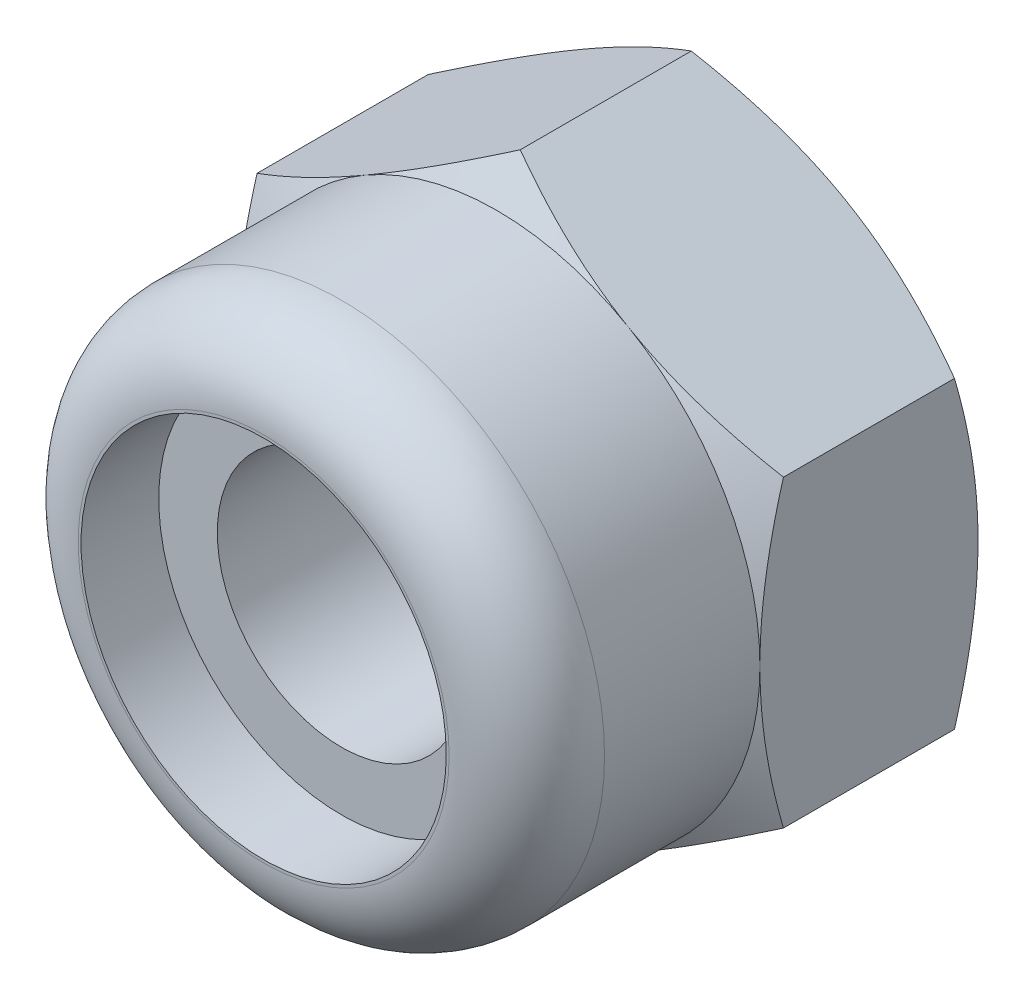
ISO-10303-21;
HEADER;
FILE_DESCRIPTION(('STEP AP214'),'2;1');
FILE_NAME('part.step','',(''),(''),'','','');
FILE_SCHEMA(('AUTOMOTIVE_DESIGN { 1 0 10303 214 1 1 1 1 }'));
ENDSEC;
DATA;
#1=APPLICATION_CONTEXT('core data for automotive mechanical design processes');
#2=APPLICATION_PROTOCOL_DEFINITION('international standard','automotive_design',2000,#1);
#3=PRODUCT_CONTEXT('',#1,'mechanical');
#4=PRODUCT('Part','Part','',(#3));
#5=PRODUCT_RELATED_PRODUCT_CATEGORY('part','',(#4));
#6=PRODUCT_DEFINITION_FORMATION('','',#4);
#7=PRODUCT_DEFINITION_CONTEXT('part definition',#1,'design');
#8=PRODUCT_DEFINITION('design','',#6,#7);
#9=PRODUCT_DEFINITION_SHAPE('','',#8);
#10=(LENGTH_UNIT() NAMED_UNIT(*) SI_UNIT(.MILLI.,.METRE.));
#11=(NAMED_UNIT(*) PLANE_ANGLE_UNIT() SI_UNIT($,.RADIAN.));
#12=(NAMED_UNIT(*) SI_UNIT($,.STERADIAN.) SOLID_ANGLE_UNIT());
#13=UNCERTAINTY_MEASURE_WITH_UNIT(LENGTH_MEASURE(1.E-05),#10,'distance_accuracy_value','');
#14=(GEOMETRIC_REPRESENTATION_CONTEXT(3) GLOBAL_UNCERTAINTY_ASSIGNED_CONTEXT((#13)) GLOBAL_UNIT_ASSIGNED_CONTEXT((#10,
#11,#12)) REPRESENTATION_CONTEXT('',''));
#15=CARTESIAN_POINT('',(0.,0.,0.));
#16=DIRECTION('',(0.,0.,1.));
#17=DIRECTION('',(1.,0.,0.));
#18=AXIS2_PLACEMENT_3D('',#15,#16,#17);
#19=CARTESIAN_POINT('',(0.,0.,-2.9));
#20=DIRECTION('',(0.,0.,1.));
#21=DIRECTION('',(1.,0.,0.));
#22=AXIS2_PLACEMENT_3D('',#19,#20,#21);
#23=CYLINDRICAL_SURFACE('',#22,1.65);
#24=CARTESIAN_POINT('',(0.,0.,2.06666666666666));
#25=DIRECTION('',(0.,0.,1.));
#26=DIRECTION('',(1.,0.,0.));
#27=AXIS2_PLACEMENT_3D('',#24,#25,#26);
#28=CIRCLE('',#27,1.65);
#29=CARTESIAN_POINT('',(1.65,0.,2.06666666666666));
#30=VERTEX_POINT('',#29);
#31=EDGE_CURVE('E270',#30,#30,#28,.T.);
#32=ORIENTED_EDGE('',*,*,#31,.T.);
#33=EDGE_LOOP('',(#32));
#34=FACE_BOUND('',#33,.T.);
#35=CARTESIAN_POINT('',(0.,0.,-2.6295273616266));
#36=DIRECTION('',(0.,0.,-1.));
#37=DIRECTION('',(-1.,0.,0.));
#38=AXIS2_PLACEMENT_3D('',#35,#36,#37);
#39=CIRCLE('',#38,1.65);
#40=CARTESIAN_POINT('',(-1.65,0.,-2.6295273616266));
#41=VERTEX_POINT('',#40);
#42=EDGE_CURVE('E37',#41,#41,#39,.F.);
#43=ORIENTED_EDGE('',*,*,#42,.F.);
#44=EDGE_LOOP('',(#43));
#45=FACE_BOUND('',#44,.T.);
#46=ADVANCED_FACE('F32',(#34,#45),#23,.F.);
#47=CARTESIAN_POINT('',(0.,4.04145188432739,-2.9));
#48=DIRECTION('',(0.,0.,-1.));
#49=DIRECTION('',(-1.,0.,0.));
#50=AXIS2_PLACEMENT_3D('',#47,#48,#49);
#51=PLANE('',#50);
#52=CARTESIAN_POINT('',(0.,0.,-2.9));
#53=DIRECTION('',(0.,0.,-1.));
#54=DIRECTION('',(-1.,0.,0.));
#55=AXIS2_PLACEMENT_3D('',#52,#53,#54);
#56=CIRCLE('',#55,3.5);
#57=CARTESIAN_POINT('',(-3.5,0.,-2.9));
#58=VERTEX_POINT('',#57);
#59=CARTESIAN_POINT('',(-1.75000000000002,-3.03108891324553,-2.9));
#60=VERTEX_POINT('',#59);
#61=EDGE_CURVE('E142',#58,#60,#56,.F.);
#62=ORIENTED_EDGE('',*,*,#61,.F.);
#63=CARTESIAN_POINT('',(-1.75000000000001,3.03108891324553,-2.9));
#64=VERTEX_POINT('',#63);
#65=EDGE_CURVE('E232',#64,#58,#56,.F.);
#66=ORIENTED_EDGE('',*,*,#65,.F.);
#67=CARTESIAN_POINT('',(1.75000000000003,3.03108891324552,-2.9));
#68=VERTEX_POINT('',#67);
#69=EDGE_CURVE('E247',#68,#64,#56,.F.);
#70=ORIENTED_EDGE('',*,*,#69,.F.);
#71=CARTESIAN_POINT('',(0.,0.,-2.9));
#72=DIRECTION('',(0.,0.,1.));
#73=DIRECTION('',(1.,0.,0.));
#74=AXIS2_PLACEMENT_3D('',#71,#72,#73);
#75=CIRCLE('',#74,3.5);
#76=CARTESIAN_POINT('',(3.5,0.,-2.9));
#77=VERTEX_POINT('',#76);
#78=EDGE_CURVE('E204',#77,#68,#75,.T.);
#79=ORIENTED_EDGE('',*,*,#78,.F.);
#80=CARTESIAN_POINT('',(1.75,-3.03108891324554,-2.9));
#81=VERTEX_POINT('',#80);
#82=EDGE_CURVE('E401',#81,#77,#56,.F.);
#83=ORIENTED_EDGE('',*,*,#82,.F.);
#84=EDGE_CURVE('E319',#60,#81,#56,.F.);
#85=ORIENTED_EDGE('',*,*,#84,.F.);
#86=EDGE_LOOP('',(#62,#66,#70,#79,#83,#85));
#87=FACE_BOUND('',#86,.T.);
#88=CARTESIAN_POINT('',(0.,0.,-2.9));
#89=DIRECTION('',(0.,0.,-1.));
#90=DIRECTION('',(-1.,0.,0.));
#91=AXIS2_PLACEMENT_3D('',#88,#89,#90);
#92=CIRCLE('',#91,2.);
#93=CARTESIAN_POINT('',(-2.,0.,-2.9));
#94=VERTEX_POINT('',#93);
#95=EDGE_CURVE('E248',#94,#94,#92,.F.);
#96=ORIENTED_EDGE('',*,*,#95,.T.);
#97=EDGE_LOOP('',(#96));
#98=FACE_BOUND('',#97,.T.);
#99=ADVANCED_FACE('F212',(#87,#98),#51,.T.);
#100=CARTESIAN_POINT('',(0.,4.04145188432739,-2.9));
#101=DIRECTION('',(-0.500000000000002,0.866025403784437,0.));
#102=DIRECTION('',(-0.866025403784437,-0.500000000000002,0.));
#103=AXIS2_PLACEMENT_3D('',#100,#101,#102);
#104=PLANE('',#103);
#105=DIRECTION('',(0.,0.,1.));
#106=VECTOR('',#105,1.);
#107=CARTESIAN_POINT('',(-3.5,2.02072594216369,-2.9));
#108=LINE('',#107,#106);
#109=CARTESIAN_POINT('',(-3.5,2.02072594216372,-2.58739260883034));
#110=VERTEX_POINT('',#109);
#111=CARTESIAN_POINT('',(-3.5,2.02072594216369,-0.312607391169646));
#112=VERTEX_POINT('',#111);
#113=EDGE_CURVE('E243',#110,#112,#108,.T.);
#114=ORIENTED_EDGE('',*,*,#113,.T.);
#115=CARTESIAN_POINT('',(-3.5002,2.02061047210985,-0.312674060693374));
#116=CARTESIAN_POINT('',(-3.34639282154755,2.10941108799267,-0.261385788989986));
#117=CARTESIAN_POINT('',(-3.19125798916558,2.19897822522909,-0.214740953816199));
#118=CARTESIAN_POINT('',(-2.87830199342322,2.37966345361545,-0.13332187553335));
#119=CARTESIAN_POINT('',(-2.7204752692125,2.47078475532382,-0.098576435584562));
#120=CARTESIAN_POINT('',(-2.40677778961987,2.65189807961073,-0.0444900271828364));
#121=CARTESIAN_POINT('',(-2.25095530083931,2.74186223545399,-0.0247890862603818));
#122=CARTESIAN_POINT('',(-1.93857711279463,2.92221386641056,-0.00127013273725479));
#123=CARTESIAN_POINT('',(-1.78202254896577,3.01260068598001,0.00256735545443411));
#124=CARTESIAN_POINT('',(-1.48949078007901,3.1814939814933,-0.00541530187697918));
#125=CARTESIAN_POINT('',(-1.35346978754209,3.26002573814993,-0.0152754340696092));
#126=CARTESIAN_POINT('',(-1.082313979711,3.41657761679354,-0.046526466899407));
#127=CARTESIAN_POINT('',(-0.947180102315312,3.49459719728458,-0.0679280432858023));
#128=CARTESIAN_POINT('',(-0.67546520759481,3.6514718648943,-0.121430407880583));
#129=CARTESIAN_POINT('',(-0.538918580721657,3.73030709667645,-0.153757994445094));
#130=CARTESIAN_POINT('',(-0.267861907055489,3.88680174018325,-0.227128933808004));
#131=CARTESIAN_POINT('',(-0.133348387531453,3.9644631568901,-0.268155046569878));
#132=CARTESIAN_POINT('',(0.000200000000010666,4.04156735438123,-0.312674060693383));
#133=B_SPLINE_CURVE_WITH_KNOTS('',3,(#115,#116,#117,#118,#119,#120,#121,#122,#123,#124,#125,
#126,#127,#128,#129,#130,#131,#132),.UNSPECIFIED.,.F.,.F.,(4,2,2,2,2,2,2,2,4),(0.,
0.554793832886255,1.11092123814984,1.65328467083219,2.19498204478403,2.66665130850861,
3.13875761298268,3.62133612600511,4.10296698719189),.UNSPECIFIED.);
#134=CARTESIAN_POINT('',(-1.75000000000001,3.03108891324553,0.));
#135=VERTEX_POINT('',#134);
#136=EDGE_CURVE('E57',#112,#135,#133,.T.);
#137=ORIENTED_EDGE('',*,*,#136,.T.);
#138=CARTESIAN_POINT('',(0.,4.04145188432739,-0.312607391169655));
#139=VERTEX_POINT('',#138);
#140=EDGE_CURVE('E195',#135,#139,#133,.T.);
#141=ORIENTED_EDGE('',*,*,#140,.T.);
#142=DIRECTION('',(0.,0.,1.));
#143=VECTOR('',#142,1.);
#144=CARTESIAN_POINT('',(0.,4.04145188432739,-2.9));
#145=LINE('',#144,#143);
#146=CARTESIAN_POINT('',(0.,4.04145188432739,-2.58739260883034));
#147=VERTEX_POINT('',#146);
#148=EDGE_CURVE('E229',#147,#139,#145,.T.);
#149=ORIENTED_EDGE('',*,*,#148,.F.);
#150=CARTESIAN_POINT('',(-3.5002,2.02061047210985,-2.58732593930663));
#151=CARTESIAN_POINT('',(-3.34639282154755,2.10941108799267,-2.63861421101001));
#152=CARTESIAN_POINT('',(-3.19125798916558,2.19897822522909,-2.6852590461838));
#153=CARTESIAN_POINT('',(-2.87830199342322,2.37966345361545,-2.76667812446665));
#154=CARTESIAN_POINT('',(-2.7204752692125,2.47078475532382,-2.80142356441544));
#155=CARTESIAN_POINT('',(-2.40677778961987,2.65189807961073,-2.85550997281716));
#156=CARTESIAN_POINT('',(-2.25095530083931,2.74186223545399,-2.87521091373962));
#157=CARTESIAN_POINT('',(-1.93857711279463,2.92221386641056,-2.89872986726275));
#158=CARTESIAN_POINT('',(-1.78202254896577,3.01260068598001,-2.90256735545443));
#159=CARTESIAN_POINT('',(-1.48949078007901,3.1814939814933,-2.89458469812302));
#160=CARTESIAN_POINT('',(-1.35346978754209,3.26002573814993,-2.88472456593039));
#161=CARTESIAN_POINT('',(-1.082313979711,3.41657761679354,-2.85347353310059));
#162=CARTESIAN_POINT('',(-0.947180102315312,3.49459719728458,-2.8320719567142));
#163=CARTESIAN_POINT('',(-0.67546520759481,3.6514718648943,-2.77856959211942));
#164=CARTESIAN_POINT('',(-0.538918580721657,3.73030709667645,-2.74624200555491));
#165=CARTESIAN_POINT('',(-0.267861907055489,3.88680174018325,-2.672871066192));
#166=CARTESIAN_POINT('',(-0.133348387531454,3.9644631568901,-2.63184495343012));
#167=CARTESIAN_POINT('',(0.000200000000010665,4.04156735438123,-2.58732593930662));
#168=B_SPLINE_CURVE_WITH_KNOTS('',3,(#150,#151,#152,#153,#154,#155,#156,#157,#158,#159,#160,
#161,#162,#163,#164,#165,#166,#167),.UNSPECIFIED.,.F.,.F.,(4,2,2,2,2,2,2,2,4),(0.,
0.554793832886255,1.11092123814984,1.65328467083219,2.19498204478403,2.66665130850861,
3.13875761298268,3.62133612600511,4.10296698719189),.UNSPECIFIED.);
#169=EDGE_CURVE('E245',#64,#147,#168,.T.);
#170=ORIENTED_EDGE('',*,*,#169,.F.);
#171=EDGE_CURVE('E224',#110,#64,#168,.T.);
#172=ORIENTED_EDGE('',*,*,#171,.F.);
#173=EDGE_LOOP('',(#114,#137,#141,#149,#170,#172));
#174=FACE_BOUND('',#173,.T.);
#175=ADVANCED_FACE('F34',(#174),#104,.T.);
#176=CARTESIAN_POINT('',(3.5,2.02072594216367,-2.9));
#177=DIRECTION('',(0.500000000000008,0.866025403784434,0.));
#178=DIRECTION('',(-0.866025403784434,0.500000000000008,0.));
#179=AXIS2_PLACEMENT_3D('',#176,#177,#178);
#180=PLANE('',#179);
#181=ORIENTED_EDGE('',*,*,#148,.T.);
#182=CARTESIAN_POINT('',(-0.000199999999989218,4.04156735438123,-0.312674060693383));
#183=CARTESIAN_POINT('',(0.15360717845246,3.95276673849841,-0.261385788989994));
#184=CARTESIAN_POINT('',(0.308742010834435,3.86319960126199,-0.214740953816206));
#185=CARTESIAN_POINT('',(0.621698006576792,3.68251437287563,-0.133321875533355));
#186=CARTESIAN_POINT('',(0.779524730787506,3.59139307116725,-0.0985764355845668));
#187=CARTESIAN_POINT('',(1.09322221038014,3.41027974688034,-0.0444900271828391));
#188=CARTESIAN_POINT('',(1.2490446991607,3.32031559103708,-0.0247890862603835));
#189=CARTESIAN_POINT('',(1.56142288720538,3.13996396008051,-0.00127013273725464));
#190=CARTESIAN_POINT('',(1.71797745103424,3.04957714051105,0.00256735545443498));
#191=CARTESIAN_POINT('',(2.010509219921,2.88068384499776,-0.0054153018769766));
#192=CARTESIAN_POINT('',(2.14653021245791,2.80215208834113,-0.0152754340696055));
#193=CARTESIAN_POINT('',(2.417686020289,2.64560020969752,-0.0465264668994013));
#194=CARTESIAN_POINT('',(2.55281989768469,2.56758062920648,-0.0679280432857958));
#195=CARTESIAN_POINT('',(2.82453479240519,2.41070596159677,-0.121430407880574));
#196=CARTESIAN_POINT('',(2.96108141927834,2.33187072981462,-0.153757994445084));
#197=CARTESIAN_POINT('',(3.2321380929445,2.17537608630781,-0.227128933807992));
#198=CARTESIAN_POINT('',(3.36665161246854,2.09771466960096,-0.268155046569865));
#199=CARTESIAN_POINT('',(3.5002,2.02061047210983,-0.312674060693369));
#200=B_SPLINE_CURVE_WITH_KNOTS('',3,(#182,#183,#184,#185,#186,#187,#188,#189,#190,#191,#192,
#193,#194,#195,#196,#197,#198,#199),.UNSPECIFIED.,.F.,.F.,(4,2,2,2,2,2,2,2,4),(0.,
0.554793832886257,1.11092123814984,1.6532846708322,2.19498204478404,2.66665130850861,
3.13875761298268,3.6213361260051,4.10296698719188),.UNSPECIFIED.);
#201=CARTESIAN_POINT('',(1.75000000000003,3.03108891324552,0.));
#202=VERTEX_POINT('',#201);
#203=EDGE_CURVE('E203',#139,#202,#200,.T.);
#204=ORIENTED_EDGE('',*,*,#203,.T.);
#205=CARTESIAN_POINT('',(3.5,2.02072594216372,-0.312607391169655));
#206=VERTEX_POINT('',#205);
#207=EDGE_CURVE('E196',#202,#206,#200,.T.);
#208=ORIENTED_EDGE('',*,*,#207,.T.);
#209=DIRECTION('',(0.,0.,1.));
#210=VECTOR('',#209,1.);
#211=CARTESIAN_POINT('',(3.5,2.02072594216367,-2.9));
#212=LINE('',#211,#210);
#213=CARTESIAN_POINT('',(3.5,2.02072594216372,-2.58739260883034));
#214=VERTEX_POINT('',#213);
#215=EDGE_CURVE('E233',#214,#206,#212,.T.);
#216=ORIENTED_EDGE('',*,*,#215,.F.);
#217=CARTESIAN_POINT('',(-0.000199999999989308,4.04156735438123,-2.58732593930662));
#218=CARTESIAN_POINT('',(0.15360717845246,3.95276673849841,-2.63861421101001));
#219=CARTESIAN_POINT('',(0.308742010834435,3.86319960126199,-2.68525904618379));
#220=CARTESIAN_POINT('',(0.621698006576792,3.68251437287563,-2.76667812446664));
#221=CARTESIAN_POINT('',(0.779524730787506,3.59139307116725,-2.80142356441543));
#222=CARTESIAN_POINT('',(1.09322221038014,3.41027974688034,-2.85550997281716));
#223=CARTESIAN_POINT('',(1.2490446991607,3.32031559103708,-2.87521091373962));
#224=CARTESIAN_POINT('',(1.56142288720538,3.13996396008051,-2.89872986726275));
#225=CARTESIAN_POINT('',(1.71797745103424,3.04957714051105,-2.90256735545443));
#226=CARTESIAN_POINT('',(2.010509219921,2.88068384499776,-2.89458469812302));
#227=CARTESIAN_POINT('',(2.14653021245791,2.80215208834113,-2.88472456593039));
#228=CARTESIAN_POINT('',(2.417686020289,2.64560020969752,-2.8534735331006));
#229=CARTESIAN_POINT('',(2.55281989768469,2.56758062920648,-2.8320719567142));
#230=CARTESIAN_POINT('',(2.82453479240519,2.41070596159677,-2.77856959211943));
#231=CARTESIAN_POINT('',(2.96108141927834,2.33187072981462,-2.74624200555492));
#232=CARTESIAN_POINT('',(3.2321380929445,2.17537608630781,-2.67287106619201));
#233=CARTESIAN_POINT('',(3.36665161246854,2.09771466960096,-2.63184495343013));
#234=CARTESIAN_POINT('',(3.5002,2.02061047210983,-2.58732593930663));
#235=B_SPLINE_CURVE_WITH_KNOTS('',3,(#217,#218,#219,#220,#221,#222,#223,#224,#225,#226,#227,
#228,#229,#230,#231,#232,#233,#234),.UNSPECIFIED.,.F.,.F.,(4,2,2,2,2,2,2,2,4),(0.,
0.554793832886257,1.11092123814984,1.6532846708322,2.19498204478404,2.66665130850861,
3.13875761298268,3.6213361260051,4.10296698719188),.UNSPECIFIED.);
#236=EDGE_CURVE('E216',#68,#214,#235,.T.);
#237=ORIENTED_EDGE('',*,*,#236,.F.);
#238=EDGE_CURVE('E222',#147,#68,#235,.T.);
#239=ORIENTED_EDGE('',*,*,#238,.F.);
#240=EDGE_LOOP('',(#181,#204,#208,#216,#237,#239));
#241=FACE_BOUND('',#240,.T.);
#242=ADVANCED_FACE('F206',(#241),#180,.T.);
#243=CARTESIAN_POINT('',(3.5,2.02072594216367,-2.9));
#244=DIRECTION('',(-1.,0.,0.));
#245=DIRECTION('',(0.,0.,1.));
#246=AXIS2_PLACEMENT_3D('',#243,#244,#245);
#247=PLANE('',#246);
#248=CARTESIAN_POINT('',(3.5,-5.35926299121408,-1.67484346858559));
#249=CARTESIAN_POINT('',(3.5,-5.20559319908844,-1.60058173692107));
#250=CARTESIAN_POINT('',(3.5,-5.05156008083378,-1.5270582283315));
#251=CARTESIAN_POINT('',(3.5,-4.74257074180713,-1.38190950344755));
#252=CARTESIAN_POINT('',(3.5,-4.5876143668244,-1.31028461582135));
#253=CARTESIAN_POINT('',(3.5,-4.27574500225545,-1.16897765517626));
#254=CARTESIAN_POINT('',(3.5,-4.11882589028195,-1.09930904568018));
#255=CARTESIAN_POINT('',(3.5,-3.80369792903858,-0.962964262242783));
#256=CARTESIAN_POINT('',(3.5,-3.64548914750598,-0.896287932319539));
#257=CARTESIAN_POINT('',(3.5,-3.32556618401858,-0.765931819095086));
#258=CARTESIAN_POINT('',(3.5,-3.16383281219926,-0.702298873688883));
#259=CARTESIAN_POINT('',(3.5,-2.838458409456,-0.580016702089508));
#260=CARTESIAN_POINT('',(3.5,-2.67481716858828,-0.521368030370706));
#261=CARTESIAN_POINT('',(3.5,-2.34570278472052,-0.410630279877034));
#262=CARTESIAN_POINT('',(3.5,-2.18023438248745,-0.358527255435869));
#263=CARTESIAN_POINT('',(3.5,-1.84694522806372,-0.262572936976452));
#264=CARTESIAN_POINT('',(3.5,-1.67912523787532,-0.218719033467166));
#265=CARTESIAN_POINT('',(3.5,-1.34101828610927,-0.141391945584792));
#266=CARTESIAN_POINT('',(3.5,-1.17073068027695,-0.107921525211978));
#267=CARTESIAN_POINT('',(3.5,-0.828102385138504,-0.0536149564320536));
#268=CARTESIAN_POINT('',(3.5,-0.655761694017321,-0.0327788191952389));
#269=CARTESIAN_POINT('',(3.5,-0.311020490924468,-0.00558408650575764));
#270=CARTESIAN_POINT('',(3.5,-0.138627397207278,0.000866163165910873));
#271=CARTESIAN_POINT('',(3.5,0.206038074906518,-0.00105355807794571));
#272=CARTESIAN_POINT('',(3.5,0.378310473023163,-0.00941968196343126));
#273=CARTESIAN_POINT('',(3.5,0.672490555822309,-0.0357688927868907));
#274=CARTESIAN_POINT('',(3.5,0.794722791084072,-0.0503206340384194));
#275=CARTESIAN_POINT('',(3.5,1.03824305430558,-0.0859367340533527));
#276=CARTESIAN_POINT('',(3.5,1.15953093025884,-0.107002119926137));
#277=CARTESIAN_POINT('',(3.5,1.52187914771345,-0.178863187081447));
#278=CARTESIAN_POINT('',(3.5,1.76124104212628,-0.238305275622003));
#279=CARTESIAN_POINT('',(3.5,2.11940971387704,-0.340826814402545));
#280=CARTESIAN_POINT('',(3.5,2.24008344316342,-0.377749699085173));
#281=CARTESIAN_POINT('',(3.5,2.48017139213724,-0.455249007699282));
#282=CARTESIAN_POINT('',(3.5,2.59958641795608,-0.495822911663538));
#283=CARTESIAN_POINT('',(3.5,2.83665760451793,-0.579779986782739));
#284=CARTESIAN_POINT('',(3.5,2.95431988203478,-0.6231460600343));
#285=CARTESIAN_POINT('',(3.5,3.18873153508794,-0.71242355956685));
#286=CARTESIAN_POINT('',(3.5,3.30548051959458,-0.758336014592933));
#287=CARTESIAN_POINT('',(3.5,3.42180736613343,-0.805270380724053));
#288=B_SPLINE_CURVE_WITH_KNOTS('',3,(#248,#249,#250,#251,#252,#253,#254,#255,#256,#257,#258,
#259,#260,#261,#262,#263,#264,#265,#266,#267,#268,#269,#270,#271,#272,#273,#274,#275,#276,#277,
#278,#279,#280,#281,#282,#283,#284,#285,#286,#287),.UNSPECIFIED.,.F.,.F.,(4,2,2,2,2,2,2,2,2,2,2,
2,2,2,2,2,2,2,2,4),(0.,0.512025318465738,1.02413870177436,1.53918270315241,2.05419982499224,
2.57553975872799,3.09693761309354,3.61720506610402,4.13730766217539,4.65754858684366,
5.17778997146963,5.69470725122284,6.21149033452403,6.58059623222333,6.94976036239486,
7.68863804939851,8.06719621660477,8.44549507476759,8.82166461280097,9.19798724733408),.UNSPECIFIED.);
#289=CARTESIAN_POINT('',(3.5,-2.02072594216372,-0.312607391169655));
#290=VERTEX_POINT('',#289);
#291=CARTESIAN_POINT('',(3.5,0.,0.));
#292=VERTEX_POINT('',#291);
#293=EDGE_CURVE('E185',#290,#292,#288,.T.);
#294=ORIENTED_EDGE('',*,*,#293,.F.);
#295=DIRECTION('',(0.,0.,1.));
#296=VECTOR('',#295,1.);
#297=CARTESIAN_POINT('',(3.5,-2.02072594216372,-2.9));
#298=LINE('',#297,#296);
#299=CARTESIAN_POINT('',(3.5,-2.02072594216372,-2.58739260883034));
#300=VERTEX_POINT('',#299);
#301=EDGE_CURVE('E236',#300,#290,#298,.T.);
#302=ORIENTED_EDGE('',*,*,#301,.F.);
#303=CARTESIAN_POINT('',(3.5,-5.35926299121408,-1.22515653141441));
#304=CARTESIAN_POINT('',(3.5,-5.20559319908844,-1.29941826307893));
#305=CARTESIAN_POINT('',(3.5,-5.05156008083378,-1.3729417716685));
#306=CARTESIAN_POINT('',(3.5,-4.74257074180713,-1.51809049655245));
#307=CARTESIAN_POINT('',(3.5,-4.5876143668244,-1.58971538417865));
#308=CARTESIAN_POINT('',(3.5,-4.27574500225545,-1.73102234482374));
#309=CARTESIAN_POINT('',(3.5,-4.11882589028195,-1.80069095431982));
#310=CARTESIAN_POINT('',(3.5,-3.80369792903858,-1.93703573775722));
#311=CARTESIAN_POINT('',(3.5,-3.64548914750598,-2.00371206768046));
#312=CARTESIAN_POINT('',(3.5,-3.32556618401858,-2.13406818090491));
#313=CARTESIAN_POINT('',(3.5,-3.16383281219926,-2.19770112631112));
#314=CARTESIAN_POINT('',(3.5,-2.838458409456,-2.31998329791049));
#315=CARTESIAN_POINT('',(3.5,-2.67481716858829,-2.37863196962929));
#316=CARTESIAN_POINT('',(3.5,-2.34570278472052,-2.48936972012297));
#317=CARTESIAN_POINT('',(3.5,-2.18023438248745,-2.54147274456413));
#318=CARTESIAN_POINT('',(3.5,-1.84694522806372,-2.63742706302355));
#319=CARTESIAN_POINT('',(3.5,-1.67912523787532,-2.68128096653283));
#320=CARTESIAN_POINT('',(3.5,-1.34101828610927,-2.75860805441521));
#321=CARTESIAN_POINT('',(3.5,-1.17073068027695,-2.79207847478802));
#322=CARTESIAN_POINT('',(3.5,-0.828102385138504,-2.84638504356795));
#323=CARTESIAN_POINT('',(3.5,-0.655761694017321,-2.86722118080476));
#324=CARTESIAN_POINT('',(3.5,-0.311020490924468,-2.89441591349424));
#325=CARTESIAN_POINT('',(3.5,-0.138627397207277,-2.90086616316591));
#326=CARTESIAN_POINT('',(3.5,0.206038074906518,-2.89894644192205));
#327=CARTESIAN_POINT('',(3.5,0.378310473023163,-2.89058031803657));
#328=CARTESIAN_POINT('',(3.5,0.672490555822309,-2.86423110721311));
#329=CARTESIAN_POINT('',(3.5,0.794722791084072,-2.84967936596158));
#330=CARTESIAN_POINT('',(3.5,1.03824305430558,-2.81406326594665));
#331=CARTESIAN_POINT('',(3.5,1.15953093025884,-2.79299788007386));
#332=CARTESIAN_POINT('',(3.5,1.52187914771345,-2.72113681291855));
#333=CARTESIAN_POINT('',(3.5,1.76124104212628,-2.661694724378));
#334=CARTESIAN_POINT('',(3.5,2.11940971387704,-2.55917318559746));
#335=CARTESIAN_POINT('',(3.5,2.24008344316342,-2.52225030091483));
#336=CARTESIAN_POINT('',(3.5,2.48017139213724,-2.44475099230072));
#337=CARTESIAN_POINT('',(3.5,2.59958641795608,-2.40417708833646));
#338=CARTESIAN_POINT('',(3.5,2.83665760451793,-2.32022001321726));
#339=CARTESIAN_POINT('',(3.5,2.95431988203478,-2.2768539399657));
#340=CARTESIAN_POINT('',(3.5,3.18873153508794,-2.18757644043315));
#341=CARTESIAN_POINT('',(3.5,3.30548051959458,-2.14166398540707));
#342=CARTESIAN_POINT('',(3.5,3.42180736613343,-2.09472961927595));
#343=B_SPLINE_CURVE_WITH_KNOTS('',3,(#303,#304,#305,#306,#307,#308,#309,#310,#311,#312,#313,
#314,#315,#316,#317,#318,#319,#320,#321,#322,#323,#324,#325,#326,#327,#328,#329,#330,#331,#332,
#333,#334,#335,#336,#337,#338,#339,#340,#341,#342),.UNSPECIFIED.,.F.,.F.,(4,2,2,2,2,2,2,2,2,2,2,
2,2,2,2,2,2,2,2,4),(0.,0.512025318465738,1.02413870177436,1.53918270315241,2.05419982499224,
2.57553975872799,3.09693761309354,3.61720506610402,4.13730766217539,4.65754858684366,
5.17778997146963,5.69470725122284,6.21149033452403,6.58059623222333,6.94976036239485,
7.68863804939851,8.06719621660477,8.44549507476759,8.82166461280097,9.19798724733407),.UNSPECIFIED.);
#344=EDGE_CURVE('E369',#300,#77,#343,.T.);
#345=ORIENTED_EDGE('',*,*,#344,.T.);
#346=EDGE_CURVE('E223',#77,#214,#343,.T.);
#347=ORIENTED_EDGE('',*,*,#346,.T.);
#348=ORIENTED_EDGE('',*,*,#215,.T.);
#349=EDGE_CURVE('E194',#292,#206,#288,.T.);
#350=ORIENTED_EDGE('',*,*,#349,.F.);
#351=EDGE_LOOP('',(#294,#302,#345,#347,#348,#350));
#352=FACE_BOUND('',#351,.T.);
#353=ADVANCED_FACE('F210',(#352),#247,.F.);
#354=CARTESIAN_POINT('',(0.,-4.04145188432741,-2.9));
#355=DIRECTION('',(0.5,-0.866025403784439,0.));
#356=DIRECTION('',(0.866025403784439,0.5,0.));
#357=AXIS2_PLACEMENT_3D('',#354,#355,#356);
#358=PLANE('',#357);
#359=ORIENTED_EDGE('',*,*,#301,.T.);
#360=CARTESIAN_POINT('',(3.5002,-2.02061047210988,-0.312674060693383));
#361=CARTESIAN_POINT('',(3.34639282154755,-2.1094110879927,-0.261385788989995));
#362=CARTESIAN_POINT('',(3.19125798916557,-2.19897822522912,-0.214740953816208));
#363=CARTESIAN_POINT('',(2.87830199342321,-2.37966345361548,-0.13332187553336));
#364=CARTESIAN_POINT('',(2.7204752692125,-2.47078475532385,-0.0985764355845723));
#365=CARTESIAN_POINT('',(2.40677778961987,-2.65189807961077,-0.0444900271828474));
#366=CARTESIAN_POINT('',(2.2509553008393,-2.74186223545402,-0.0247890862603932));
#367=CARTESIAN_POINT('',(1.93857711279462,-2.92221386641059,-0.00127013273726715));
#368=CARTESIAN_POINT('',(1.78202254896576,-3.01260068598004,0.00256735545442127));
#369=CARTESIAN_POINT('',(1.489490780079,-3.18149398149333,-0.00541530187699288));
#370=CARTESIAN_POINT('',(1.35346978754208,-3.26002573814996,-0.0152754340696232));
#371=CARTESIAN_POINT('',(1.082313979711,-3.41657761679357,-0.0465264668994211));
#372=CARTESIAN_POINT('',(0.947180102315308,-3.49459719728461,-0.0679280432858164));
#373=CARTESIAN_POINT('',(0.675465207594808,-3.65147186489432,-0.121430407880597));
#374=CARTESIAN_POINT('',(0.538918580721657,-3.73030709667647,-0.153757994445107));
#375=CARTESIAN_POINT('',(0.267861907055492,-3.88680174018327,-0.227128933808015));
#376=CARTESIAN_POINT('',(0.133348387531458,-3.96446315689012,-0.268155046569888));
#377=CARTESIAN_POINT('',(-0.000200000000004952,-4.04156735438125,-0.312674060693392));
#378=B_SPLINE_CURVE_WITH_KNOTS('',3,(#360,#361,#362,#363,#364,#365,#366,#367,#368,#369,#370,
#371,#372,#373,#374,#375,#376,#377),.UNSPECIFIED.,.F.,.F.,(4,2,2,2,2,2,2,2,4),(0.,
0.554793832886257,1.11092123814984,1.6532846708322,2.19498204478404,2.66665130850861,
3.13875761298268,3.6213361260051,4.10296698719188),.UNSPECIFIED.);
#379=CARTESIAN_POINT('',(1.75,-3.03108891324553,0.));
#380=VERTEX_POINT('',#379);
#381=EDGE_CURVE('E363',#290,#380,#378,.T.);
#382=ORIENTED_EDGE('',*,*,#381,.T.);
#383=CARTESIAN_POINT('',(0.,-4.04145188432739,-0.312607391169655));
#384=VERTEX_POINT('',#383);
#385=EDGE_CURVE('E179',#380,#384,#378,.T.);
#386=ORIENTED_EDGE('',*,*,#385,.T.);
#387=DIRECTION('',(0.,0.,1.));
#388=VECTOR('',#387,1.);
#389=CARTESIAN_POINT('',(0.,-4.04145188432741,-2.9));
#390=LINE('',#389,#388);
#391=CARTESIAN_POINT('',(0.,-4.04145188432739,-2.58739260883034));
#392=VERTEX_POINT('',#391);
#393=EDGE_CURVE('E239',#392,#384,#390,.T.);
#394=ORIENTED_EDGE('',*,*,#393,.F.);
#395=CARTESIAN_POINT('',(3.5002,-2.02061047210988,-2.58732593930662));
#396=CARTESIAN_POINT('',(3.34639282154755,-2.1094110879927,-2.63861421101));
#397=CARTESIAN_POINT('',(3.19125798916557,-2.19897822522912,-2.68525904618379));
#398=CARTESIAN_POINT('',(2.87830199342321,-2.37966345361548,-2.76667812446664));
#399=CARTESIAN_POINT('',(2.7204752692125,-2.47078475532385,-2.80142356441543));
#400=CARTESIAN_POINT('',(2.40677778961987,-2.65189807961077,-2.85550997281715));
#401=CARTESIAN_POINT('',(2.2509553008393,-2.74186223545402,-2.87521091373961));
#402=CARTESIAN_POINT('',(1.93857711279462,-2.92221386641059,-2.89872986726273));
#403=CARTESIAN_POINT('',(1.78202254896576,-3.01260068598004,-2.90256735545442));
#404=CARTESIAN_POINT('',(1.489490780079,-3.18149398149333,-2.89458469812301));
#405=CARTESIAN_POINT('',(1.35346978754208,-3.26002573814996,-2.88472456593038));
#406=CARTESIAN_POINT('',(1.082313979711,-3.41657761679357,-2.85347353310058));
#407=CARTESIAN_POINT('',(0.947180102315308,-3.49459719728461,-2.83207195671418));
#408=CARTESIAN_POINT('',(0.675465207594808,-3.65147186489432,-2.7785695921194));
#409=CARTESIAN_POINT('',(0.538918580721657,-3.73030709667647,-2.74624200555489));
#410=CARTESIAN_POINT('',(0.267861907055492,-3.88680174018327,-2.67287106619198));
#411=CARTESIAN_POINT('',(0.133348387531458,-3.96446315689012,-2.63184495343011));
#412=CARTESIAN_POINT('',(-0.000200000000004955,-4.04156735438125,-2.58732593930661));
#413=B_SPLINE_CURVE_WITH_KNOTS('',3,(#395,#396,#397,#398,#399,#400,#401,#402,#403,#404,#405,
#406,#407,#408,#409,#410,#411,#412),.UNSPECIFIED.,.F.,.F.,(4,2,2,2,2,2,2,2,4),(0.,
0.554793832886257,1.11092123814984,1.6532846708322,2.19498204478404,2.66665130850861,
3.13875761298268,3.6213361260051,4.10296698719188),.UNSPECIFIED.);
#414=EDGE_CURVE('E341',#81,#392,#413,.T.);
#415=ORIENTED_EDGE('',*,*,#414,.F.);
#416=EDGE_CURVE('E365',#300,#81,#413,.T.);
#417=ORIENTED_EDGE('',*,*,#416,.F.);
#418=EDGE_LOOP('',(#359,#382,#386,#394,#415,#417));
#419=FACE_BOUND('',#418,.T.);
#420=ADVANCED_FACE('F348',(#419),#358,.T.);
#421=CARTESIAN_POINT('',(-3.5,-2.0207259421637,-2.9));
#422=DIRECTION('',(-0.500000000000004,-0.866025403784436,0.));
#423=DIRECTION('',(0.866025403784436,-0.500000000000004,0.));
#424=AXIS2_PLACEMENT_3D('',#421,#422,#423);
#425=PLANE('',#424);
#426=ORIENTED_EDGE('',*,*,#393,.T.);
#427=CARTESIAN_POINT('',(0.000199999999994783,-4.04156735438125,-0.312674060693393));
#428=CARTESIAN_POINT('',(-0.153607178452456,-3.95276673849843,-0.261385788990004));
#429=CARTESIAN_POINT('',(-0.308742010834431,-3.86319960126201,-0.214740953816216));
#430=CARTESIAN_POINT('',(-0.62169800657679,-3.68251437287565,-0.133321875533365));
#431=CARTESIAN_POINT('',(-0.779524730787506,-3.59139307116727,-0.0985764355845767));
#432=CARTESIAN_POINT('',(-1.09322221038014,-3.41027974688036,-0.0444900271828493));
#433=CARTESIAN_POINT('',(-1.2490446991607,-3.3203155910371,-0.0247890862603937));
#434=CARTESIAN_POINT('',(-1.56142288720539,-3.13996396008053,-0.00127013273726541));
#435=CARTESIAN_POINT('',(-1.71797745103425,-3.04957714051107,0.00256735545442386));
#436=CARTESIAN_POINT('',(-2.010509219921,-2.88068384499778,-0.0054153018769882));
#437=CARTESIAN_POINT('',(-2.14653021245792,-2.80215208834115,-0.0152754340696172));
#438=CARTESIAN_POINT('',(-2.41768602028901,-2.64560020969755,-0.046526466899413));
#439=CARTESIAN_POINT('',(-2.55281989768469,-2.56758062920651,-0.0679280432858075));
#440=CARTESIAN_POINT('',(-2.82453479240519,-2.41070596159679,-0.121430407880586));
#441=CARTESIAN_POINT('',(-2.96108141927834,-2.33187072981465,-0.153757994445095));
#442=CARTESIAN_POINT('',(-3.2321380929445,-2.17537608630784,-0.227128933808002));
#443=CARTESIAN_POINT('',(-3.36665161246854,-2.09771466960099,-0.268155046569874));
#444=CARTESIAN_POINT('',(-3.5002,-2.02061047210986,-0.312674060693378));
#445=B_SPLINE_CURVE_WITH_KNOTS('',3,(#427,#428,#429,#430,#431,#432,#433,#434,#435,#436,#437,
#438,#439,#440,#441,#442,#443,#444),.UNSPECIFIED.,.F.,.F.,(4,2,2,2,2,2,2,2,4),(0.,
0.554793832886259,1.11092123814985,1.6532846708322,2.19498204478405,2.66665130850862,
3.13875761298269,3.62133612600511,4.10296698719188),.UNSPECIFIED.);
#446=CARTESIAN_POINT('',(-1.75000000000001,-3.03108891324552,0.));
#447=VERTEX_POINT('',#446);
#448=EDGE_CURVE('E148',#384,#447,#445,.T.);
#449=ORIENTED_EDGE('',*,*,#448,.T.);
#450=CARTESIAN_POINT('',(-3.5,-2.02072594216372,-0.312607391169655));
#451=VERTEX_POINT('',#450);
#452=EDGE_CURVE('E139',#447,#451,#445,.T.);
#453=ORIENTED_EDGE('',*,*,#452,.T.);
#454=DIRECTION('',(0.,0.,1.));
#455=VECTOR('',#454,1.);
#456=CARTESIAN_POINT('',(-3.5,-2.0207259421637,-2.9));
#457=LINE('',#456,#455);
#458=CARTESIAN_POINT('',(-3.5,-2.02072594216372,-2.58739260883034));
#459=VERTEX_POINT('',#458);
#460=EDGE_CURVE('E147',#459,#451,#457,.T.);
#461=ORIENTED_EDGE('',*,*,#460,.F.);
#462=CARTESIAN_POINT('',(0.000199999999994992,-4.04156735438125,-2.58732593930661));
#463=CARTESIAN_POINT('',(-0.153607178452455,-3.95276673849843,-2.63861421101));
#464=CARTESIAN_POINT('',(-0.308742010834431,-3.86319960126201,-2.68525904618378));
#465=CARTESIAN_POINT('',(-0.62169800657679,-3.68251437287565,-2.76667812446663));
#466=CARTESIAN_POINT('',(-0.779524730787506,-3.59139307116727,-2.80142356441542));
#467=CARTESIAN_POINT('',(-1.09322221038014,-3.41027974688036,-2.85550997281715));
#468=CARTESIAN_POINT('',(-1.2490446991607,-3.3203155910371,-2.87521091373961));
#469=CARTESIAN_POINT('',(-1.56142288720539,-3.13996396008053,-2.89872986726273));
#470=CARTESIAN_POINT('',(-1.71797745103425,-3.04957714051107,-2.90256735545442));
#471=CARTESIAN_POINT('',(-2.010509219921,-2.88068384499778,-2.89458469812301));
#472=CARTESIAN_POINT('',(-2.14653021245792,-2.80215208834115,-2.88472456593038));
#473=CARTESIAN_POINT('',(-2.417686020289,-2.64560020969755,-2.85347353310059));
#474=CARTESIAN_POINT('',(-2.55281989768469,-2.56758062920651,-2.83207195671419));
#475=CARTESIAN_POINT('',(-2.82453479240519,-2.41070596159679,-2.77856959211941));
#476=CARTESIAN_POINT('',(-2.96108141927834,-2.33187072981465,-2.7462420055549));
#477=CARTESIAN_POINT('',(-3.2321380929445,-2.17537608630784,-2.672871066192));
#478=CARTESIAN_POINT('',(-3.36665161246854,-2.09771466960099,-2.63184495343013));
#479=CARTESIAN_POINT('',(-3.5002,-2.02061047210986,-2.58732593930662));
#480=B_SPLINE_CURVE_WITH_KNOTS('',3,(#462,#463,#464,#465,#466,#467,#468,#469,#470,#471,#472,
#473,#474,#475,#476,#477,#478,#479),.UNSPECIFIED.,.F.,.F.,(4,2,2,2,2,2,2,2,4),(0.,
0.554793832886259,1.11092123814985,1.6532846708322,2.19498204478405,2.66665130850862,
3.13875761298269,3.62133612600511,4.10296698719188),.UNSPECIFIED.);
#481=EDGE_CURVE('E330',#60,#459,#480,.T.);
#482=ORIENTED_EDGE('',*,*,#481,.F.);
#483=EDGE_CURVE('E340',#392,#60,#480,.T.);
#484=ORIENTED_EDGE('',*,*,#483,.F.);
#485=EDGE_LOOP('',(#426,#449,#453,#461,#482,#484));
#486=FACE_BOUND('',#485,.T.);
#487=ADVANCED_FACE('F345',(#486),#425,.T.);
#488=CARTESIAN_POINT('',(-3.5,2.02072594216369,-2.9));
#489=DIRECTION('',(-1.,0.,0.));
#490=DIRECTION('',(0.,0.,1.));
#491=AXIS2_PLACEMENT_3D('',#488,#489,#490);
#492=PLANE('',#491);
#493=ORIENTED_EDGE('',*,*,#460,.T.);
#494=CARTESIAN_POINT('',(-3.5,-5.35926299121406,-1.67484346858558));
#495=CARTESIAN_POINT('',(-3.5,-5.20559319908842,-1.60058173692106));
#496=CARTESIAN_POINT('',(-3.5,-5.05156008083376,-1.52705822833149));
#497=CARTESIAN_POINT('',(-3.5,-4.74257074180711,-1.38190950344754));
#498=CARTESIAN_POINT('',(-3.5,-4.58761436682437,-1.31028461582135));
#499=CARTESIAN_POINT('',(-3.5,-4.27574500225543,-1.16897765517625));
#500=CARTESIAN_POINT('',(-3.5,-4.11882589028193,-1.09930904568017));
#501=CARTESIAN_POINT('',(-3.5,-3.80369792903856,-0.962964262242775));
#502=CARTESIAN_POINT('',(-3.5,-3.64548914750596,-0.896287932319532));
#503=CARTESIAN_POINT('',(-3.5,-3.32556618401856,-0.765931819095079));
#504=CARTESIAN_POINT('',(-3.5,-3.16383281219925,-0.702298873688876));
#505=CARTESIAN_POINT('',(-3.5,-2.83845840945598,-0.580016702089503));
#506=CARTESIAN_POINT('',(-3.5,-2.67481716858827,-0.5213680303707));
#507=CARTESIAN_POINT('',(-3.5,-2.3457027847205,-0.410630279877029));
#508=CARTESIAN_POINT('',(-3.5,-2.18023438248743,-0.358527255435864));
#509=CARTESIAN_POINT('',(-3.5,-1.84694522806371,-0.262572936976448));
#510=CARTESIAN_POINT('',(-3.5,-1.67912523787531,-0.218719033467162));
#511=CARTESIAN_POINT('',(-3.5,-1.34101828610926,-0.14139194558479));
#512=CARTESIAN_POINT('',(-3.5,-1.17073068027694,-0.107921525211975));
#513=CARTESIAN_POINT('',(-3.5,-0.82810238513849,-0.0536149564320517));
#514=CARTESIAN_POINT('',(-3.5,-0.655761694017307,-0.0327788191952374));
#515=CARTESIAN_POINT('',(-3.5,-0.311020490924454,-0.00558408650575708));
#516=CARTESIAN_POINT('',(-3.5,-0.138627397207264,0.000866163165910989));
#517=CARTESIAN_POINT('',(-3.5,0.206038074906532,-0.00105355807794633));
#518=CARTESIAN_POINT('',(-3.5,0.378310473023176,-0.00941968196343217));
#519=CARTESIAN_POINT('',(-3.5,0.672490555822323,-0.0357688927868922));
#520=CARTESIAN_POINT('',(-3.5,0.794722791084086,-0.0503206340384213));
#521=CARTESIAN_POINT('',(-3.5,1.03824305430559,-0.0859367340533552));
#522=CARTESIAN_POINT('',(-3.5,1.15953093025885,-0.10700211992614));
#523=CARTESIAN_POINT('',(-3.5,1.52187914771346,-0.178863187081451));
#524=CARTESIAN_POINT('',(-3.5,1.7612410421263,-0.238305275622008));
#525=CARTESIAN_POINT('',(-3.5,2.11940971387706,-0.340826814402551));
#526=CARTESIAN_POINT('',(-3.5,2.24008344316344,-0.377749699085179));
#527=CARTESIAN_POINT('',(-3.5,2.48017139213726,-0.455249007699289));
#528=CARTESIAN_POINT('',(-3.5,2.5995864179561,-0.495822911663544));
#529=CARTESIAN_POINT('',(-3.5,2.83665760451795,-0.579779986782746));
#530=CARTESIAN_POINT('',(-3.5,2.9543198820348,-0.623146060034308));
#531=CARTESIAN_POINT('',(-3.5,3.18873153508796,-0.712423559566859));
#532=CARTESIAN_POINT('',(-3.5,3.3054805195946,-0.758336014592942));
#533=CARTESIAN_POINT('',(-3.5,3.42180736613345,-0.805270380724063));
#534=B_SPLINE_CURVE_WITH_KNOTS('',3,(#494,#495,#496,#497,#498,#499,#500,#501,#502,#503,#504,
#505,#506,#507,#508,#509,#510,#511,#512,#513,#514,#515,#516,#517,#518,#519,#520,#521,#522,#523,
#524,#525,#526,#527,#528,#529,#530,#531,#532,#533),.UNSPECIFIED.,.F.,.F.,(4,2,2,2,2,2,2,2,2,2,2,
2,2,2,2,2,2,2,2,4),(0.,0.512025318465737,1.02413870177436,1.53918270315241,2.05419982499223,
2.57553975872798,3.09693761309353,3.61720506610401,4.13730766217538,4.65754858684365,
5.17778997146962,5.69470725122283,6.21149033452402,6.58059623222332,6.94976036239485,
7.6886380493985,8.06719621660477,8.44549507476759,8.82166461280097,9.19798724733408),.UNSPECIFIED.);
#535=CARTESIAN_POINT('',(-3.5,0.,0.));
#536=VERTEX_POINT('',#535);
#537=EDGE_CURVE('E132',#451,#536,#534,.T.);
#538=ORIENTED_EDGE('',*,*,#537,.T.);
#539=EDGE_CURVE('E126',#536,#112,#534,.T.);
#540=ORIENTED_EDGE('',*,*,#539,.T.);
#541=ORIENTED_EDGE('',*,*,#113,.F.);
#542=CARTESIAN_POINT('',(-3.5,-5.35926299121406,-1.22515653141442));
#543=CARTESIAN_POINT('',(-3.5,-5.20559319908842,-1.29941826307894));
#544=CARTESIAN_POINT('',(-3.5,-5.05156008083376,-1.37294177166851));
#545=CARTESIAN_POINT('',(-3.5,-4.74257074180711,-1.51809049655246));
#546=CARTESIAN_POINT('',(-3.5,-4.58761436682437,-1.58971538417865));
#547=CARTESIAN_POINT('',(-3.5,-4.27574500225543,-1.73102234482375));
#548=CARTESIAN_POINT('',(-3.5,-4.11882589028193,-1.80069095431983));
#549=CARTESIAN_POINT('',(-3.5,-3.80369792903856,-1.93703573775723));
#550=CARTESIAN_POINT('',(-3.5,-3.64548914750596,-2.00371206768047));
#551=CARTESIAN_POINT('',(-3.5,-3.32556618401856,-2.13406818090492));
#552=CARTESIAN_POINT('',(-3.5,-3.16383281219924,-2.19770112631112));
#553=CARTESIAN_POINT('',(-3.5,-2.83845840945598,-2.3199832979105));
#554=CARTESIAN_POINT('',(-3.5,-2.67481716858827,-2.3786319696293));
#555=CARTESIAN_POINT('',(-3.5,-2.3457027847205,-2.48936972012297));
#556=CARTESIAN_POINT('',(-3.5,-2.18023438248743,-2.54147274456414));
#557=CARTESIAN_POINT('',(-3.5,-1.8469452280637,-2.63742706302355));
#558=CARTESIAN_POINT('',(-3.5,-1.67912523787531,-2.68128096653284));
#559=CARTESIAN_POINT('',(-3.5,-1.34101828610926,-2.75860805441521));
#560=CARTESIAN_POINT('',(-3.5,-1.17073068027694,-2.79207847478802));
#561=CARTESIAN_POINT('',(-3.5,-0.828102385138491,-2.84638504356795));
#562=CARTESIAN_POINT('',(-3.5,-0.655761694017308,-2.86722118080476));
#563=CARTESIAN_POINT('',(-3.5,-0.311020490924455,-2.89441591349424));
#564=CARTESIAN_POINT('',(-3.5,-0.138627397207265,-2.90086616316591));
#565=CARTESIAN_POINT('',(-3.5,0.206038074906531,-2.89894644192205));
#566=CARTESIAN_POINT('',(-3.5,0.378310473023176,-2.89058031803657));
#567=CARTESIAN_POINT('',(-3.5,0.672490555822323,-2.86423110721311));
#568=CARTESIAN_POINT('',(-3.5,0.794722791084086,-2.84967936596158));
#569=CARTESIAN_POINT('',(-3.5,1.03824305430559,-2.81406326594664));
#570=CARTESIAN_POINT('',(-3.5,1.15953093025886,-2.79299788007386));
#571=CARTESIAN_POINT('',(-3.5,1.52187914771347,-2.72113681291855));
#572=CARTESIAN_POINT('',(-3.5,1.7612410421263,-2.66169472437799));
#573=CARTESIAN_POINT('',(-3.5,2.11940971387706,-2.55917318559745));
#574=CARTESIAN_POINT('',(-3.5,2.24008344316344,-2.52225030091482));
#575=CARTESIAN_POINT('',(-3.5,2.48017139213726,-2.44475099230071));
#576=CARTESIAN_POINT('',(-3.5,2.5995864179561,-2.40417708833645));
#577=CARTESIAN_POINT('',(-3.5,2.83665760451795,-2.32022001321725));
#578=CARTESIAN_POINT('',(-3.5,2.9543198820348,-2.27685393996569));
#579=CARTESIAN_POINT('',(-3.5,3.18873153508796,-2.18757644043314));
#580=CARTESIAN_POINT('',(-3.5,3.3054805195946,-2.14166398540706));
#581=CARTESIAN_POINT('',(-3.5,3.42180736613345,-2.09472961927594));
#582=B_SPLINE_CURVE_WITH_KNOTS('',3,(#542,#543,#544,#545,#546,#547,#548,#549,#550,#551,#552,
#553,#554,#555,#556,#557,#558,#559,#560,#561,#562,#563,#564,#565,#566,#567,#568,#569,#570,#571,
#572,#573,#574,#575,#576,#577,#578,#579,#580,#581),.UNSPECIFIED.,.F.,.F.,(4,2,2,2,2,2,2,2,2,2,2,
2,2,2,2,2,2,2,2,4),(0.,0.512025318465738,1.02413870177436,1.53918270315241,2.05419982499224,
2.57553975872798,3.09693761309353,3.61720506610401,4.13730766217538,4.65754858684365,
5.17778997146962,5.69470725122283,6.21149033452402,6.58059623222332,6.94976036239485,
7.6886380493985,8.06719621660477,8.44549507476759,8.82166461280097,9.19798724733408),.UNSPECIFIED.);
#583=EDGE_CURVE('E327',#58,#110,#582,.T.);
#584=ORIENTED_EDGE('',*,*,#583,.F.);
#585=EDGE_CURVE('E329',#459,#58,#582,.T.);
#586=ORIENTED_EDGE('',*,*,#585,.F.);
#587=EDGE_LOOP('',(#493,#538,#540,#541,#584,#586));
#588=FACE_BOUND('',#587,.T.);
#589=ADVANCED_FACE('F144',(#588),#492,.T.);
#590=CARTESIAN_POINT('',(0.,0.,-2.9));
#591=DIRECTION('',(0.,0.,1.));
#592=DIRECTION('',(1.,0.,0.));
#593=AXIS2_PLACEMENT_3D('',#590,#591,#592);
#594=CONICAL_SURFACE('',#593,3.5,1.04719755119659);
#595=ORIENTED_EDGE('',*,*,#171,.T.);
#596=ORIENTED_EDGE('',*,*,#65,.T.);
#597=ORIENTED_EDGE('',*,*,#583,.T.);
#598=EDGE_LOOP('',(#595,#596,#597));
#599=FACE_BOUND('',#598,.T.);
#600=ADVANCED_FACE('F325',(#599),#594,.T.);
#601=ORIENTED_EDGE('',*,*,#169,.T.);
#602=ORIENTED_EDGE('',*,*,#238,.T.);
#603=ORIENTED_EDGE('',*,*,#69,.T.);
#604=EDGE_LOOP('',(#601,#602,#603));
#605=FACE_BOUND('',#604,.T.);
#606=ADVANCED_FACE('F399',(#605),#594,.T.);
#607=ORIENTED_EDGE('',*,*,#236,.T.);
#608=ORIENTED_EDGE('',*,*,#346,.F.);
#609=ORIENTED_EDGE('',*,*,#78,.T.);
#610=EDGE_LOOP('',(#607,#608,#609));
#611=FACE_BOUND('',#610,.T.);
#612=ADVANCED_FACE('F403',(#611),#594,.T.);
#613=ORIENTED_EDGE('',*,*,#416,.T.);
#614=ORIENTED_EDGE('',*,*,#82,.T.);
#615=ORIENTED_EDGE('',*,*,#344,.F.);
#616=EDGE_LOOP('',(#613,#614,#615));
#617=FACE_BOUND('',#616,.T.);
#618=ADVANCED_FACE('F402',(#617),#594,.T.);
#619=ORIENTED_EDGE('',*,*,#414,.T.);
#620=ORIENTED_EDGE('',*,*,#483,.T.);
#621=ORIENTED_EDGE('',*,*,#84,.T.);
#622=EDGE_LOOP('',(#619,#620,#621));
#623=FACE_BOUND('',#622,.T.);
#624=ADVANCED_FACE('F389',(#623),#594,.T.);
#625=ORIENTED_EDGE('',*,*,#481,.T.);
#626=ORIENTED_EDGE('',*,*,#585,.T.);
#627=ORIENTED_EDGE('',*,*,#61,.T.);
#628=EDGE_LOOP('',(#625,#626,#627));
#629=FACE_BOUND('',#628,.T.);
#630=ADVANCED_FACE('F167',(#629),#594,.T.);
#631=CARTESIAN_POINT('',(0.,0.,0.));
#632=DIRECTION('',(0.,0.,-1.));
#633=DIRECTION('',(-1.,0.,0.));
#634=AXIS2_PLACEMENT_3D('',#631,#632,#633);
#635=CONICAL_SURFACE('',#634,3.5,1.04719755119659);
#636=CARTESIAN_POINT('',(0.,0.,0.));
#637=DIRECTION('',(0.,0.,-1.));
#638=DIRECTION('',(-1.,0.,0.));
#639=AXIS2_PLACEMENT_3D('',#636,#637,#638);
#640=CIRCLE('',#639,3.5);
#641=EDGE_CURVE('E44',#447,#536,#640,.T.);
#642=ORIENTED_EDGE('',*,*,#641,.T.);
#643=ORIENTED_EDGE('',*,*,#537,.F.);
#644=ORIENTED_EDGE('',*,*,#452,.F.);
#645=EDGE_LOOP('',(#642,#643,#644));
#646=FACE_BOUND('',#645,.T.);
#647=ADVANCED_FACE('F137',(#646),#635,.T.);
#648=EDGE_CURVE('E141',#380,#447,#640,.T.);
#649=ORIENTED_EDGE('',*,*,#648,.T.);
#650=ORIENTED_EDGE('',*,*,#448,.F.);
#651=ORIENTED_EDGE('',*,*,#385,.F.);
#652=EDGE_LOOP('',(#649,#650,#651));
#653=FACE_BOUND('',#652,.T.);
#654=ADVANCED_FACE('F166',(#653),#635,.T.);
#655=ORIENTED_EDGE('',*,*,#293,.T.);
#656=EDGE_CURVE('E393',#292,#380,#640,.T.);
#657=ORIENTED_EDGE('',*,*,#656,.T.);
#658=ORIENTED_EDGE('',*,*,#381,.F.);
#659=EDGE_LOOP('',(#655,#657,#658));
#660=FACE_BOUND('',#659,.T.);
#661=ADVANCED_FACE('F519',(#660),#635,.T.);
#662=CARTESIAN_POINT('',(0.,0.,0.));
#663=DIRECTION('',(0.,0.,1.));
#664=DIRECTION('',(1.,0.,0.));
#665=AXIS2_PLACEMENT_3D('',#662,#663,#664);
#666=CIRCLE('',#665,3.5);
#667=EDGE_CURVE('E133',#292,#202,#666,.T.);
#668=ORIENTED_EDGE('',*,*,#667,.F.);
#669=ORIENTED_EDGE('',*,*,#349,.T.);
#670=ORIENTED_EDGE('',*,*,#207,.F.);
#671=EDGE_LOOP('',(#668,#669,#670));
#672=FACE_BOUND('',#671,.T.);
#673=ADVANCED_FACE('F377',(#672),#635,.T.);
#674=EDGE_CURVE('E42',#135,#202,#640,.T.);
#675=ORIENTED_EDGE('',*,*,#674,.T.);
#676=ORIENTED_EDGE('',*,*,#203,.F.);
#677=ORIENTED_EDGE('',*,*,#140,.F.);
#678=EDGE_LOOP('',(#675,#676,#677));
#679=FACE_BOUND('',#678,.T.);
#680=ADVANCED_FACE('F168',(#679),#635,.T.);
#681=ORIENTED_EDGE('',*,*,#539,.F.);
#682=EDGE_CURVE('E11',#536,#135,#640,.T.);
#683=ORIENTED_EDGE('',*,*,#682,.T.);
#684=ORIENTED_EDGE('',*,*,#136,.F.);
#685=EDGE_LOOP('',(#681,#683,#684));
#686=FACE_BOUND('',#685,.T.);
#687=ADVANCED_FACE('F127',(#686),#635,.T.);
#688=CARTESIAN_POINT('',(0.,0.,-2.8746));
#689=DIRECTION('',(0.,0.,-1.));
#690=DIRECTION('',(-1.,0.,0.));
#691=AXIS2_PLACEMENT_3D('',#688,#689,#690);
#692=CONICAL_SURFACE('',#691,2.,0.95993108859688);
#693=CARTESIAN_POINT('',(0.,0.,-2.8746));
#694=DIRECTION('',(0.,0.,1.));
#695=DIRECTION('',(1.,0.,0.));
#696=AXIS2_PLACEMENT_3D('',#693,#694,#695);
#697=CIRCLE('',#696,2.);
#698=CARTESIAN_POINT('',(2.,0.,-2.8746));
#699=VERTEX_POINT('',#698);
#700=EDGE_CURVE('E250',#699,#699,#697,.T.);
#701=ORIENTED_EDGE('',*,*,#700,.F.);
#702=EDGE_LOOP('',(#701));
#703=FACE_BOUND('',#702,.T.);
#704=ORIENTED_EDGE('',*,*,#42,.T.);
#705=EDGE_LOOP('',(#704));
#706=FACE_BOUND('',#705,.T.);
#707=ADVANCED_FACE('F485',(#703,#706),#692,.F.);
#708=CARTESIAN_POINT('',(0.,0.,-25.0375057290932));
#709=DIRECTION('',(0.,0.,1.));
#710=DIRECTION('',(1.,0.,0.));
#711=AXIS2_PLACEMENT_3D('',#708,#709,#710);
#712=CYLINDRICAL_SURFACE('',#711,2.);
#713=ORIENTED_EDGE('',*,*,#95,.F.);
#714=EDGE_LOOP('',(#713));
#715=FACE_BOUND('',#714,.T.);
#716=ORIENTED_EDGE('',*,*,#700,.T.);
#717=EDGE_LOOP('',(#716));
#718=FACE_BOUND('',#717,.T.);
#719=ADVANCED_FACE('F169',(#715,#718),#712,.F.);
#720=CARTESIAN_POINT('',(0.,1.65,2.06666666666666));
#721=DIRECTION('',(0.,0.,-1.));
#722=DIRECTION('',(-1.,0.,0.));
#723=AXIS2_PLACEMENT_3D('',#720,#721,#722);
#724=PLANE('',#723);
#725=ORIENTED_EDGE('',*,*,#31,.F.);
#726=EDGE_LOOP('',(#725));
#727=FACE_BOUND('',#726,.T.);
#728=CARTESIAN_POINT('',(0.,0.,2.06666666666666));
#729=DIRECTION('',(0.,0.,1.));
#730=DIRECTION('',(1.,0.,0.));
#731=AXIS2_PLACEMENT_3D('',#728,#729,#730);
#732=CIRCLE('',#731,2.42857142857143);
#733=CARTESIAN_POINT('',(2.42857142857143,0.,2.06666666666666));
#734=VERTEX_POINT('',#733);
#735=EDGE_CURVE('E255',#734,#734,#732,.T.);
#736=ORIENTED_EDGE('',*,*,#735,.T.);
#737=EDGE_LOOP('',(#736));
#738=FACE_BOUND('',#737,.T.);
#739=ADVANCED_FACE('F276',(#727,#738),#724,.F.);
#740=CARTESIAN_POINT('',(0.,0.,9.48088822457563));
#741=DIRECTION('',(0.,0.,1.));
#742=DIRECTION('',(1.,0.,0.));
#743=AXIS2_PLACEMENT_3D('',#740,#741,#742);
#744=CYLINDRICAL_SURFACE('',#743,2.42857142857143);
#745=ORIENTED_EDGE('',*,*,#735,.F.);
#746=EDGE_LOOP('',(#745));
#747=FACE_BOUND('',#746,.T.);
#748=CARTESIAN_POINT('',(0.,0.,3.1));
#749=DIRECTION('',(0.,0.,1.));
#750=DIRECTION('',(1.,0.,0.));
#751=AXIS2_PLACEMENT_3D('',#748,#749,#750);
#752=CIRCLE('',#751,2.42857142857143);
#753=CARTESIAN_POINT('',(2.42857142857143,0.,3.1));
#754=VERTEX_POINT('',#753);
#755=EDGE_CURVE('E259',#754,#754,#752,.T.);
#756=ORIENTED_EDGE('',*,*,#755,.T.);
#757=EDGE_LOOP('',(#756));
#758=FACE_BOUND('',#757,.T.);
#759=ADVANCED_FACE('F279',(#747,#758),#744,.F.);
#760=CARTESIAN_POINT('',(0.,2.42857142857143,3.1));
#761=DIRECTION('',(0.,0.,-1.));
#762=DIRECTION('',(-1.,0.,0.));
#763=AXIS2_PLACEMENT_3D('',#760,#761,#762);
#764=PLANE('',#763);
#765=ORIENTED_EDGE('',*,*,#755,.F.);
#766=EDGE_LOOP('',(#765));
#767=FACE_BOUND('',#766,.T.);
#768=CARTESIAN_POINT('',(0.,0.,3.1));
#769=DIRECTION('',(0.,0.,1.));
#770=DIRECTION('',(1.,0.,0.));
#771=AXIS2_PLACEMENT_3D('',#768,#769,#770);
#772=CIRCLE('',#771,2.46666666666666);
#773=CARTESIAN_POINT('',(2.46666666666666,0.,3.1));
#774=VERTEX_POINT('',#773);
#775=EDGE_CURVE('E264',#774,#774,#772,.T.);
#776=ORIENTED_EDGE('',*,*,#775,.T.);
#777=EDGE_LOOP('',(#776));
#778=FACE_BOUND('',#777,.T.);
#779=ADVANCED_FACE('F285',(#767,#778),#764,.F.);
#780=CARTESIAN_POINT('',(0.,0.,2.06666666666666));
#781=DIRECTION('',(0.,0.,1.));
#782=DIRECTION('',(1.,0.,0.));
#783=AXIS2_PLACEMENT_3D('',#780,#781,#782);
#784=TOROIDAL_SURFACE('',#783,2.46666666666666,1.03333333333333);
#785=ORIENTED_EDGE('',*,*,#775,.F.);
#786=EDGE_LOOP('',(#785));
#787=FACE_BOUND('',#786,.T.);
#788=CARTESIAN_POINT('',(0.,0.,2.06666666666666));
#789=DIRECTION('',(0.,0.,1.));
#790=DIRECTION('',(1.,0.,0.));
#791=AXIS2_PLACEMENT_3D('',#788,#789,#790);
#792=CIRCLE('',#791,3.5);
#793=CARTESIAN_POINT('',(3.5,0.,2.06666666666666));
#794=VERTEX_POINT('',#793);
#795=EDGE_CURVE('E267',#794,#794,#792,.T.);
#796=ORIENTED_EDGE('',*,*,#795,.T.);
#797=EDGE_LOOP('',(#796));
#798=FACE_BOUND('',#797,.T.);
#799=ADVANCED_FACE('F291',(#787,#798),#784,.T.);
#800=CARTESIAN_POINT('',(0.,0.,9.48088822457563));
#801=DIRECTION('',(0.,0.,1.));
#802=DIRECTION('',(1.,0.,0.));
#803=AXIS2_PLACEMENT_3D('',#800,#801,#802);
#804=CYLINDRICAL_SURFACE('',#803,3.5);
#805=ORIENTED_EDGE('',*,*,#641,.F.);
#806=ORIENTED_EDGE('',*,*,#648,.F.);
#807=ORIENTED_EDGE('',*,*,#656,.F.);
#808=ORIENTED_EDGE('',*,*,#667,.T.);
#809=ORIENTED_EDGE('',*,*,#674,.F.);
#810=ORIENTED_EDGE('',*,*,#682,.F.);
#811=EDGE_LOOP('',(#805,#806,#807,#808,#809,#810));
#812=FACE_BOUND('',#811,.T.);
#813=ORIENTED_EDGE('',*,*,#795,.F.);
#814=EDGE_LOOP('',(#813));
#815=FACE_BOUND('',#814,.T.);
#816=ADVANCED_FACE('F122',(#812,#815),#804,.T.);
#817=CLOSED_SHELL('',(#46,#99,#175,#242,#353,#420,#487,#589,#600,#606,#612,#618,#624,#630,#647,
#654,#661,#673,#680,#687,#707,#719,#739,#759,#779,#799,#816));
#818=MANIFOLD_SOLID_BREP('B2',#817);
#819=ADVANCED_BREP_SHAPE_REPRESENTATION('',(#18,#818),#14);
#820=SHAPE_DEFINITION_REPRESENTATION(#9,#819);
ENDSEC;
END-ISO-10303-21;
